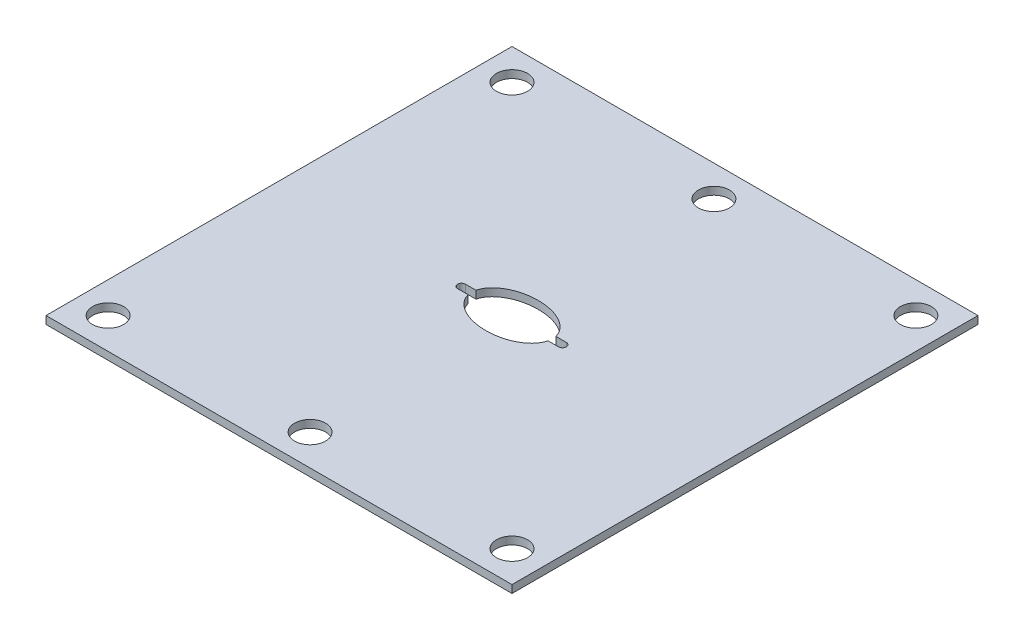
ISO-10303-21;
HEADER;
FILE_DESCRIPTION(('STEP AP214'),'2;1');
FILE_NAME('part.step','',(''),(''),'','','');
FILE_SCHEMA(('AUTOMOTIVE_DESIGN { 1 0 10303 214 1 1 1 1 }'));
ENDSEC;
DATA;
#1=APPLICATION_CONTEXT('core data for automotive mechanical design processes');
#2=APPLICATION_PROTOCOL_DEFINITION('international standard','automotive_design',2000,#1);
#3=PRODUCT_CONTEXT('',#1,'mechanical');
#4=PRODUCT('Part','Part','',(#3));
#5=PRODUCT_RELATED_PRODUCT_CATEGORY('part','',(#4));
#6=PRODUCT_DEFINITION_FORMATION('','',#4);
#7=PRODUCT_DEFINITION_CONTEXT('part definition',#1,'design');
#8=PRODUCT_DEFINITION('design','',#6,#7);
#9=PRODUCT_DEFINITION_SHAPE('','',#8);
#10=(LENGTH_UNIT() NAMED_UNIT(*) SI_UNIT(.MILLI.,.METRE.));
#11=(NAMED_UNIT(*) PLANE_ANGLE_UNIT() SI_UNIT($,.RADIAN.));
#12=(NAMED_UNIT(*) SI_UNIT($,.STERADIAN.) SOLID_ANGLE_UNIT());
#13=UNCERTAINTY_MEASURE_WITH_UNIT(LENGTH_MEASURE(1.E-05),#10,'distance_accuracy_value','');
#14=(GEOMETRIC_REPRESENTATION_CONTEXT(3) GLOBAL_UNCERTAINTY_ASSIGNED_CONTEXT((#13)) GLOBAL_UNIT_ASSIGNED_CONTEXT((#10,
#11,#12)) REPRESENTATION_CONTEXT('',''));
#15=CARTESIAN_POINT('',(0.,0.,0.));
#16=DIRECTION('',(0.,0.,1.));
#17=DIRECTION('',(1.,0.,0.));
#18=AXIS2_PLACEMENT_3D('',#15,#16,#17);
#19=CARTESIAN_POINT('',(6.5,-4.,0.499999999999996));
#20=DIRECTION('',(0.,0.,1.));
#21=DIRECTION('',(1.,0.,0.));
#22=AXIS2_PLACEMENT_3D('',#19,#20,#21);
#23=PLANE('',#22);
#24=DIRECTION('',(1.,0.,0.));
#25=VECTOR('',#24,1.);
#26=CARTESIAN_POINT('',(0.,0.,0.499999999999996));
#27=LINE('',#26,#25);
#28=CARTESIAN_POINT('',(5.13604626023031,0.,0.499999999999996));
#29=VERTEX_POINT('',#28);
#30=CARTESIAN_POINT('',(6.5,0.,0.499999999999996));
#31=VERTEX_POINT('',#30);
#32=EDGE_CURVE('E155',#29,#31,#27,.T.);
#33=ORIENTED_EDGE('',*,*,#32,.F.);
#34=DIRECTION('',(0.,1.,0.));
#35=VECTOR('',#34,1.);
#36=CARTESIAN_POINT('',(5.13604626023031,-4.,0.499999999999996));
#37=LINE('',#36,#35);
#38=CARTESIAN_POINT('',(5.13604626023031,1.,0.499999999999996));
#39=VERTEX_POINT('',#38);
#40=EDGE_CURVE('E148',#29,#39,#37,.T.);
#41=ORIENTED_EDGE('',*,*,#40,.T.);
#42=DIRECTION('',(1.,0.,0.));
#43=VECTOR('',#42,1.);
#44=CARTESIAN_POINT('',(6.5,1.,0.499999999999996));
#45=LINE('',#44,#43);
#46=CARTESIAN_POINT('',(6.5,1.,0.499999999999996));
#47=VERTEX_POINT('',#46);
#48=EDGE_CURVE('E138',#39,#47,#45,.T.);
#49=ORIENTED_EDGE('',*,*,#48,.T.);
#50=DIRECTION('',(0.,1.,0.));
#51=VECTOR('',#50,1.);
#52=CARTESIAN_POINT('',(6.5,-4.,0.499999999999996));
#53=LINE('',#52,#51);
#54=EDGE_CURVE('E152',#31,#47,#53,.T.);
#55=ORIENTED_EDGE('',*,*,#54,.F.);
#56=EDGE_LOOP('',(#33,#41,#49,#55));
#57=FACE_BOUND('',#56,.T.);
#58=ADVANCED_FACE('F34',(#57),#23,.F.);
#59=CARTESIAN_POINT('',(6.5,-4.,-0.499999999999996));
#60=DIRECTION('',(0.,0.,-1.));
#61=DIRECTION('',(-1.,0.,0.));
#62=AXIS2_PLACEMENT_3D('',#59,#60,#61);
#63=PLANE('',#62);
#64=DIRECTION('',(-1.,0.,0.));
#65=VECTOR('',#64,1.);
#66=CARTESIAN_POINT('',(0.,0.,-0.499999999999996));
#67=LINE('',#66,#65);
#68=CARTESIAN_POINT('',(-5.13604626023031,0.,-0.499999999999996));
#69=VERTEX_POINT('',#68);
#70=CARTESIAN_POINT('',(-6.5,0.,-0.499999999999996));
#71=VERTEX_POINT('',#70);
#72=EDGE_CURVE('E160',#69,#71,#67,.T.);
#73=ORIENTED_EDGE('',*,*,#72,.F.);
#74=DIRECTION('',(0.,1.,0.));
#75=VECTOR('',#74,1.);
#76=CARTESIAN_POINT('',(-5.13604626023031,-4.,-0.499999999999996));
#77=LINE('',#76,#75);
#78=CARTESIAN_POINT('',(-5.13604626023031,1.,-0.499999999999996));
#79=VERTEX_POINT('',#78);
#80=EDGE_CURVE('E11',#69,#79,#77,.T.);
#81=ORIENTED_EDGE('',*,*,#80,.T.);
#82=DIRECTION('',(-1.,0.,0.));
#83=VECTOR('',#82,1.);
#84=CARTESIAN_POINT('',(6.5,1.,-0.499999999999996));
#85=LINE('',#84,#83);
#86=CARTESIAN_POINT('',(-6.5,1.,-0.499999999999996));
#87=VERTEX_POINT('',#86);
#88=EDGE_CURVE('E144',#79,#87,#85,.T.);
#89=ORIENTED_EDGE('',*,*,#88,.T.);
#90=DIRECTION('',(0.,1.,0.));
#91=VECTOR('',#90,1.);
#92=CARTESIAN_POINT('',(-6.5,-4.,-0.499999999999996));
#93=LINE('',#92,#91);
#94=EDGE_CURVE('E242',#87,#71,#93,.F.);
#95=ORIENTED_EDGE('',*,*,#94,.T.);
#96=EDGE_LOOP('',(#73,#81,#89,#95));
#97=FACE_BOUND('',#96,.T.);
#98=ADVANCED_FACE('F264',(#97),#63,.F.);
#99=CARTESIAN_POINT('',(-6.5,-4.,0.));
#100=DIRECTION('',(0.,1.,0.));
#101=DIRECTION('',(0.,0.,1.));
#102=AXIS2_PLACEMENT_3D('',#99,#100,#101);
#103=CYLINDRICAL_SURFACE('',#102,0.5);
#104=ORIENTED_EDGE('',*,*,#94,.F.);
#105=CARTESIAN_POINT('',(-6.5,1.,0.));
#106=DIRECTION('',(0.,1.,0.));
#107=DIRECTION('',(0.,0.,1.));
#108=AXIS2_PLACEMENT_3D('',#105,#106,#107);
#109=CIRCLE('',#108,0.5);
#110=CARTESIAN_POINT('',(-6.5,1.,0.499999999999996));
#111=VERTEX_POINT('',#110);
#112=EDGE_CURVE('E164',#87,#111,#109,.T.);
#113=ORIENTED_EDGE('',*,*,#112,.T.);
#114=DIRECTION('',(0.,1.,0.));
#115=VECTOR('',#114,1.);
#116=CARTESIAN_POINT('',(-6.5,-4.,0.5));
#117=LINE('',#116,#115);
#118=CARTESIAN_POINT('',(-6.5,0.,0.500000000000003));
#119=VERTEX_POINT('',#118);
#120=EDGE_CURVE('E143',#111,#119,#117,.F.);
#121=ORIENTED_EDGE('',*,*,#120,.T.);
#122=CARTESIAN_POINT('',(-6.5,0.,0.));
#123=DIRECTION('',(0.,1.,0.));
#124=DIRECTION('',(0.,0.,1.));
#125=AXIS2_PLACEMENT_3D('',#122,#123,#124);
#126=CIRCLE('',#125,0.5);
#127=EDGE_CURVE('E166',#71,#119,#126,.T.);
#128=ORIENTED_EDGE('',*,*,#127,.F.);
#129=EDGE_LOOP('',(#104,#113,#121,#128));
#130=FACE_BOUND('',#129,.T.);
#131=ADVANCED_FACE('F269',(#130),#103,.F.);
#132=CARTESIAN_POINT('',(-30.,1.,30.));
#133=DIRECTION('',(1.,0.,0.));
#134=DIRECTION('',(0.,0.,-1.));
#135=AXIS2_PLACEMENT_3D('',#132,#133,#134);
#136=PLANE('',#135);
#137=DIRECTION('',(0.,0.,1.));
#138=VECTOR('',#137,1.);
#139=CARTESIAN_POINT('',(-30.,0.,30.));
#140=LINE('',#139,#138);
#141=CARTESIAN_POINT('',(-30.,0.,-30.));
#142=VERTEX_POINT('',#141);
#143=CARTESIAN_POINT('',(-30.,0.,30.));
#144=VERTEX_POINT('',#143);
#145=EDGE_CURVE('E207',#142,#144,#140,.T.);
#146=ORIENTED_EDGE('',*,*,#145,.T.);
#147=DIRECTION('',(0.,-1.,0.));
#148=VECTOR('',#147,1.);
#149=CARTESIAN_POINT('',(-30.,1.,30.));
#150=LINE('',#149,#148);
#151=CARTESIAN_POINT('',(-30.,1.,30.));
#152=VERTEX_POINT('',#151);
#153=EDGE_CURVE('E234',#152,#144,#150,.T.);
#154=ORIENTED_EDGE('',*,*,#153,.F.);
#155=DIRECTION('',(0.,0.,1.));
#156=VECTOR('',#155,1.);
#157=CARTESIAN_POINT('',(-30.,1.,30.));
#158=LINE('',#157,#156);
#159=CARTESIAN_POINT('',(-30.,1.,-30.));
#160=VERTEX_POINT('',#159);
#161=EDGE_CURVE('E208',#160,#152,#158,.T.);
#162=ORIENTED_EDGE('',*,*,#161,.F.);
#163=DIRECTION('',(0.,-1.,0.));
#164=VECTOR('',#163,1.);
#165=CARTESIAN_POINT('',(-30.,1.,-30.));
#166=LINE('',#165,#164);
#167=EDGE_CURVE('E218',#160,#142,#166,.T.);
#168=ORIENTED_EDGE('',*,*,#167,.T.);
#169=EDGE_LOOP('',(#146,#154,#162,#168));
#170=FACE_BOUND('',#169,.T.);
#171=ADVANCED_FACE('F36',(#170),#136,.F.);
#172=CARTESIAN_POINT('',(30.,1.,30.));
#173=DIRECTION('',(0.,0.,-1.));
#174=DIRECTION('',(-1.,0.,0.));
#175=AXIS2_PLACEMENT_3D('',#172,#173,#174);
#176=PLANE('',#175);
#177=DIRECTION('',(1.,0.,0.));
#178=VECTOR('',#177,1.);
#179=CARTESIAN_POINT('',(30.,0.,30.));
#180=LINE('',#179,#178);
#181=CARTESIAN_POINT('',(30.,0.,30.));
#182=VERTEX_POINT('',#181);
#183=EDGE_CURVE('E221',#144,#182,#180,.T.);
#184=ORIENTED_EDGE('',*,*,#183,.T.);
#185=DIRECTION('',(0.,-1.,0.));
#186=VECTOR('',#185,1.);
#187=CARTESIAN_POINT('',(30.,1.,30.));
#188=LINE('',#187,#186);
#189=CARTESIAN_POINT('',(30.,1.,30.));
#190=VERTEX_POINT('',#189);
#191=EDGE_CURVE('E231',#190,#182,#188,.T.);
#192=ORIENTED_EDGE('',*,*,#191,.F.);
#193=DIRECTION('',(1.,0.,0.));
#194=VECTOR('',#193,1.);
#195=CARTESIAN_POINT('',(30.,1.,30.));
#196=LINE('',#195,#194);
#197=EDGE_CURVE('E211',#152,#190,#196,.T.);
#198=ORIENTED_EDGE('',*,*,#197,.F.);
#199=ORIENTED_EDGE('',*,*,#153,.T.);
#200=EDGE_LOOP('',(#184,#192,#198,#199));
#201=FACE_BOUND('',#200,.T.);
#202=ADVANCED_FACE('F317',(#201),#176,.F.);
#203=CARTESIAN_POINT('',(30.,1.,30.));
#204=DIRECTION('',(-1.,0.,0.));
#205=DIRECTION('',(0.,0.,1.));
#206=AXIS2_PLACEMENT_3D('',#203,#204,#205);
#207=PLANE('',#206);
#208=DIRECTION('',(0.,0.,-1.));
#209=VECTOR('',#208,1.);
#210=CARTESIAN_POINT('',(30.,0.,30.));
#211=LINE('',#210,#209);
#212=CARTESIAN_POINT('',(30.,0.,-30.));
#213=VERTEX_POINT('',#212);
#214=EDGE_CURVE('E223',#182,#213,#211,.T.);
#215=ORIENTED_EDGE('',*,*,#214,.T.);
#216=DIRECTION('',(0.,-1.,0.));
#217=VECTOR('',#216,1.);
#218=CARTESIAN_POINT('',(30.,1.,-30.));
#219=LINE('',#218,#217);
#220=CARTESIAN_POINT('',(30.,1.,-30.));
#221=VERTEX_POINT('',#220);
#222=EDGE_CURVE('E228',#221,#213,#219,.T.);
#223=ORIENTED_EDGE('',*,*,#222,.F.);
#224=DIRECTION('',(0.,0.,-1.));
#225=VECTOR('',#224,1.);
#226=CARTESIAN_POINT('',(30.,1.,30.));
#227=LINE('',#226,#225);
#228=EDGE_CURVE('E214',#190,#221,#227,.T.);
#229=ORIENTED_EDGE('',*,*,#228,.F.);
#230=ORIENTED_EDGE('',*,*,#191,.T.);
#231=EDGE_LOOP('',(#215,#223,#229,#230));
#232=FACE_BOUND('',#231,.T.);
#233=ADVANCED_FACE('F314',(#232),#207,.F.);
#234=CARTESIAN_POINT('',(30.,1.,-30.));
#235=DIRECTION('',(0.,0.,1.));
#236=DIRECTION('',(1.,0.,0.));
#237=AXIS2_PLACEMENT_3D('',#234,#235,#236);
#238=PLANE('',#237);
#239=DIRECTION('',(-1.,0.,0.));
#240=VECTOR('',#239,1.);
#241=CARTESIAN_POINT('',(30.,0.,-30.));
#242=LINE('',#241,#240);
#243=EDGE_CURVE('E212',#213,#142,#242,.T.);
#244=ORIENTED_EDGE('',*,*,#243,.T.);
#245=ORIENTED_EDGE('',*,*,#167,.F.);
#246=DIRECTION('',(-1.,0.,0.));
#247=VECTOR('',#246,1.);
#248=CARTESIAN_POINT('',(30.,1.,-30.));
#249=LINE('',#248,#247);
#250=EDGE_CURVE('E216',#221,#160,#249,.T.);
#251=ORIENTED_EDGE('',*,*,#250,.F.);
#252=ORIENTED_EDGE('',*,*,#222,.T.);
#253=EDGE_LOOP('',(#244,#245,#251,#252));
#254=FACE_BOUND('',#253,.T.);
#255=ADVANCED_FACE('F309',(#254),#238,.F.);
#256=CARTESIAN_POINT('',(0.,1.,0.));
#257=DIRECTION('',(0.,1.,0.));
#258=DIRECTION('',(0.,0.,1.));
#259=AXIS2_PLACEMENT_3D('',#256,#257,#258);
#260=PLANE('',#259);
#261=CARTESIAN_POINT('',(0.,1.,0.));
#262=DIRECTION('',(0.,1.,0.));
#263=DIRECTION('',(-1.,0.,0.));
#264=AXIS2_PLACEMENT_3D('',#261,#262,#263);
#265=ELLIPSE('',#264,5.19355355723705,3.3692356937772);
#266=CARTESIAN_POINT('',(-5.13604626023031,1.,0.499999999999996));
#267=VERTEX_POINT('',#266);
#268=EDGE_CURVE('E123',#267,#39,#265,.T.);
#269=ORIENTED_EDGE('',*,*,#268,.F.);
#270=EDGE_CURVE('E135',#111,#267,#45,.T.);
#271=ORIENTED_EDGE('',*,*,#270,.F.);
#272=ORIENTED_EDGE('',*,*,#112,.F.);
#273=ORIENTED_EDGE('',*,*,#88,.F.);
#274=CARTESIAN_POINT('',(5.13604626023031,1.,-0.499999999999996));
#275=VERTEX_POINT('',#274);
#276=EDGE_CURVE('E139',#275,#79,#265,.T.);
#277=ORIENTED_EDGE('',*,*,#276,.F.);
#278=CARTESIAN_POINT('',(6.5,1.,-0.499999999999996));
#279=VERTEX_POINT('',#278);
#280=EDGE_CURVE('E146',#279,#275,#85,.T.);
#281=ORIENTED_EDGE('',*,*,#280,.F.);
#282=CARTESIAN_POINT('',(6.5,1.,0.));
#283=DIRECTION('',(0.,1.,0.));
#284=DIRECTION('',(0.,0.,1.));
#285=AXIS2_PLACEMENT_3D('',#282,#283,#284);
#286=CIRCLE('',#285,0.500000000000001);
#287=EDGE_CURVE('E167',#47,#279,#286,.T.);
#288=ORIENTED_EDGE('',*,*,#287,.F.);
#289=ORIENTED_EDGE('',*,*,#48,.F.);
#290=EDGE_LOOP('',(#269,#271,#272,#273,#277,#281,#288,#289));
#291=FACE_BOUND('',#290,.T.);
#292=CARTESIAN_POINT('',(26.,1.,-26.));
#293=DIRECTION('',(0.,1.,0.));
#294=DIRECTION('',(0.,0.,1.));
#295=AXIS2_PLACEMENT_3D('',#292,#293,#294);
#296=CIRCLE('',#295,2.);
#297=CARTESIAN_POINT('',(26.,1.,-24.));
#298=VERTEX_POINT('',#297);
#299=EDGE_CURVE('E171',#298,#298,#296,.T.);
#300=ORIENTED_EDGE('',*,*,#299,.F.);
#301=EDGE_LOOP('',(#300));
#302=FACE_BOUND('',#301,.T.);
#303=CARTESIAN_POINT('',(0.,1.,-26.));
#304=DIRECTION('',(0.,1.,0.));
#305=DIRECTION('',(0.,0.,1.));
#306=AXIS2_PLACEMENT_3D('',#303,#304,#305);
#307=CIRCLE('',#306,2.);
#308=CARTESIAN_POINT('',(0.,1.,-24.));
#309=VERTEX_POINT('',#308);
#310=EDGE_CURVE('E177',#309,#309,#307,.T.);
#311=ORIENTED_EDGE('',*,*,#310,.F.);
#312=EDGE_LOOP('',(#311));
#313=FACE_BOUND('',#312,.T.);
#314=CARTESIAN_POINT('',(-26.,1.,-26.));
#315=DIRECTION('',(0.,1.,0.));
#316=DIRECTION('',(0.,0.,1.));
#317=AXIS2_PLACEMENT_3D('',#314,#315,#316);
#318=CIRCLE('',#317,2.);
#319=CARTESIAN_POINT('',(-26.,1.,-24.));
#320=VERTEX_POINT('',#319);
#321=EDGE_CURVE('E183',#320,#320,#318,.T.);
#322=ORIENTED_EDGE('',*,*,#321,.F.);
#323=EDGE_LOOP('',(#322));
#324=FACE_BOUND('',#323,.T.);
#325=CARTESIAN_POINT('',(0.,1.,26.));
#326=DIRECTION('',(0.,1.,0.));
#327=DIRECTION('',(0.,0.,1.));
#328=AXIS2_PLACEMENT_3D('',#325,#326,#327);
#329=CIRCLE('',#328,2.);
#330=CARTESIAN_POINT('',(0.,1.,28.));
#331=VERTEX_POINT('',#330);
#332=EDGE_CURVE('E189',#331,#331,#329,.T.);
#333=ORIENTED_EDGE('',*,*,#332,.F.);
#334=EDGE_LOOP('',(#333));
#335=FACE_BOUND('',#334,.T.);
#336=CARTESIAN_POINT('',(26.,1.,26.));
#337=DIRECTION('',(0.,1.,0.));
#338=DIRECTION('',(0.,0.,1.));
#339=AXIS2_PLACEMENT_3D('',#336,#337,#338);
#340=CIRCLE('',#339,2.);
#341=CARTESIAN_POINT('',(26.,1.,28.));
#342=VERTEX_POINT('',#341);
#343=EDGE_CURVE('E195',#342,#342,#340,.T.);
#344=ORIENTED_EDGE('',*,*,#343,.F.);
#345=EDGE_LOOP('',(#344));
#346=FACE_BOUND('',#345,.T.);
#347=CARTESIAN_POINT('',(-26.,1.,26.));
#348=DIRECTION('',(0.,1.,0.));
#349=DIRECTION('',(0.,0.,1.));
#350=AXIS2_PLACEMENT_3D('',#347,#348,#349);
#351=CIRCLE('',#350,2.);
#352=CARTESIAN_POINT('',(-26.,1.,28.));
#353=VERTEX_POINT('',#352);
#354=EDGE_CURVE('E201',#353,#353,#351,.T.);
#355=ORIENTED_EDGE('',*,*,#354,.F.);
#356=EDGE_LOOP('',(#355));
#357=FACE_BOUND('',#356,.T.);
#358=ORIENTED_EDGE('',*,*,#161,.T.);
#359=ORIENTED_EDGE('',*,*,#197,.T.);
#360=ORIENTED_EDGE('',*,*,#228,.T.);
#361=ORIENTED_EDGE('',*,*,#250,.T.);
#362=EDGE_LOOP('',(#358,#359,#360,#361));
#363=FACE_BOUND('',#362,.T.);
#364=ADVANCED_FACE('F132',(#291,#302,#313,#324,#335,#346,#357,#363),#260,.T.);
#365=CARTESIAN_POINT('',(0.,0.,0.));
#366=DIRECTION('',(0.,1.,0.));
#367=DIRECTION('',(0.,0.,1.));
#368=AXIS2_PLACEMENT_3D('',#365,#366,#367);
#369=PLANE('',#368);
#370=CARTESIAN_POINT('',(-5.13604626023031,0.,0.499999999999996));
#371=VERTEX_POINT('',#370);
#372=EDGE_CURVE('E158',#119,#371,#27,.T.);
#373=ORIENTED_EDGE('',*,*,#372,.T.);
#374=CARTESIAN_POINT('',(0.,0.,0.));
#375=DIRECTION('',(0.,1.,0.));
#376=DIRECTION('',(-1.,0.,0.));
#377=AXIS2_PLACEMENT_3D('',#374,#375,#376);
#378=ELLIPSE('',#377,5.19355355723705,3.3692356937772);
#379=EDGE_CURVE('E49',#371,#29,#378,.T.);
#380=ORIENTED_EDGE('',*,*,#379,.T.);
#381=ORIENTED_EDGE('',*,*,#32,.T.);
#382=CARTESIAN_POINT('',(6.5,0.,0.));
#383=DIRECTION('',(0.,1.,0.));
#384=DIRECTION('',(0.,0.,1.));
#385=AXIS2_PLACEMENT_3D('',#382,#383,#384);
#386=CIRCLE('',#385,0.500000000000001);
#387=CARTESIAN_POINT('',(6.5,0.,-0.499999999999996));
#388=VERTEX_POINT('',#387);
#389=EDGE_CURVE('E170',#31,#388,#386,.T.);
#390=ORIENTED_EDGE('',*,*,#389,.T.);
#391=CARTESIAN_POINT('',(5.13604626023031,0.,-0.499999999999996));
#392=VERTEX_POINT('',#391);
#393=EDGE_CURVE('E161',#388,#392,#67,.T.);
#394=ORIENTED_EDGE('',*,*,#393,.T.);
#395=EDGE_CURVE('E57',#392,#69,#378,.T.);
#396=ORIENTED_EDGE('',*,*,#395,.T.);
#397=ORIENTED_EDGE('',*,*,#72,.T.);
#398=ORIENTED_EDGE('',*,*,#127,.T.);
#399=EDGE_LOOP('',(#373,#380,#381,#390,#394,#396,#397,#398));
#400=FACE_BOUND('',#399,.T.);
#401=CARTESIAN_POINT('',(26.,0.,-26.));
#402=DIRECTION('',(0.,1.,0.));
#403=DIRECTION('',(0.,0.,1.));
#404=AXIS2_PLACEMENT_3D('',#401,#402,#403);
#405=CIRCLE('',#404,2.);
#406=CARTESIAN_POINT('',(26.,0.,-24.));
#407=VERTEX_POINT('',#406);
#408=EDGE_CURVE('E174',#407,#407,#405,.T.);
#409=ORIENTED_EDGE('',*,*,#408,.T.);
#410=EDGE_LOOP('',(#409));
#411=FACE_BOUND('',#410,.T.);
#412=CARTESIAN_POINT('',(0.,0.,-26.));
#413=DIRECTION('',(0.,1.,0.));
#414=DIRECTION('',(0.,0.,1.));
#415=AXIS2_PLACEMENT_3D('',#412,#413,#414);
#416=CIRCLE('',#415,2.);
#417=CARTESIAN_POINT('',(0.,0.,-24.));
#418=VERTEX_POINT('',#417);
#419=EDGE_CURVE('E180',#418,#418,#416,.T.);
#420=ORIENTED_EDGE('',*,*,#419,.T.);
#421=EDGE_LOOP('',(#420));
#422=FACE_BOUND('',#421,.T.);
#423=CARTESIAN_POINT('',(-26.,0.,-26.));
#424=DIRECTION('',(0.,1.,0.));
#425=DIRECTION('',(0.,0.,1.));
#426=AXIS2_PLACEMENT_3D('',#423,#424,#425);
#427=CIRCLE('',#426,2.);
#428=CARTESIAN_POINT('',(-26.,0.,-24.));
#429=VERTEX_POINT('',#428);
#430=EDGE_CURVE('E186',#429,#429,#427,.T.);
#431=ORIENTED_EDGE('',*,*,#430,.T.);
#432=EDGE_LOOP('',(#431));
#433=FACE_BOUND('',#432,.T.);
#434=CARTESIAN_POINT('',(0.,0.,26.));
#435=DIRECTION('',(0.,1.,0.));
#436=DIRECTION('',(0.,0.,1.));
#437=AXIS2_PLACEMENT_3D('',#434,#435,#436);
#438=CIRCLE('',#437,2.);
#439=CARTESIAN_POINT('',(0.,0.,28.));
#440=VERTEX_POINT('',#439);
#441=EDGE_CURVE('E192',#440,#440,#438,.T.);
#442=ORIENTED_EDGE('',*,*,#441,.T.);
#443=EDGE_LOOP('',(#442));
#444=FACE_BOUND('',#443,.T.);
#445=CARTESIAN_POINT('',(26.,0.,26.));
#446=DIRECTION('',(0.,1.,0.));
#447=DIRECTION('',(0.,0.,1.));
#448=AXIS2_PLACEMENT_3D('',#445,#446,#447);
#449=CIRCLE('',#448,2.);
#450=CARTESIAN_POINT('',(26.,0.,28.));
#451=VERTEX_POINT('',#450);
#452=EDGE_CURVE('E198',#451,#451,#449,.T.);
#453=ORIENTED_EDGE('',*,*,#452,.T.);
#454=EDGE_LOOP('',(#453));
#455=FACE_BOUND('',#454,.T.);
#456=CARTESIAN_POINT('',(-26.,0.,26.));
#457=DIRECTION('',(0.,1.,0.));
#458=DIRECTION('',(0.,0.,1.));
#459=AXIS2_PLACEMENT_3D('',#456,#457,#458);
#460=CIRCLE('',#459,2.);
#461=CARTESIAN_POINT('',(-26.,0.,28.));
#462=VERTEX_POINT('',#461);
#463=EDGE_CURVE('E204',#462,#462,#460,.T.);
#464=ORIENTED_EDGE('',*,*,#463,.T.);
#465=EDGE_LOOP('',(#464));
#466=FACE_BOUND('',#465,.T.);
#467=ORIENTED_EDGE('',*,*,#145,.F.);
#468=ORIENTED_EDGE('',*,*,#243,.F.);
#469=ORIENTED_EDGE('',*,*,#214,.F.);
#470=ORIENTED_EDGE('',*,*,#183,.F.);
#471=EDGE_LOOP('',(#467,#468,#469,#470));
#472=FACE_BOUND('',#471,.T.);
#473=ADVANCED_FACE('F250',(#400,#411,#422,#433,#444,#455,#466,#472),#369,.F.);
#474=CARTESIAN_POINT('',(-26.,1.,26.));
#475=DIRECTION('',(0.,1.,0.));
#476=DIRECTION('',(0.,0.,1.));
#477=AXIS2_PLACEMENT_3D('',#474,#475,#476);
#478=CYLINDRICAL_SURFACE('',#477,2.);
#479=ORIENTED_EDGE('',*,*,#463,.F.);
#480=EDGE_LOOP('',(#479));
#481=FACE_BOUND('',#480,.T.);
#482=ORIENTED_EDGE('',*,*,#354,.T.);
#483=EDGE_LOOP('',(#482));
#484=FACE_BOUND('',#483,.T.);
#485=ADVANCED_FACE('F302',(#481,#484),#478,.F.);
#486=CARTESIAN_POINT('',(26.,1.,26.));
#487=DIRECTION('',(0.,1.,0.));
#488=DIRECTION('',(0.,0.,1.));
#489=AXIS2_PLACEMENT_3D('',#486,#487,#488);
#490=CYLINDRICAL_SURFACE('',#489,2.);
#491=ORIENTED_EDGE('',*,*,#452,.F.);
#492=EDGE_LOOP('',(#491));
#493=FACE_BOUND('',#492,.T.);
#494=ORIENTED_EDGE('',*,*,#343,.T.);
#495=EDGE_LOOP('',(#494));
#496=FACE_BOUND('',#495,.T.);
#497=ADVANCED_FACE('F298',(#493,#496),#490,.F.);
#498=CARTESIAN_POINT('',(0.,1.,26.));
#499=DIRECTION('',(0.,1.,0.));
#500=DIRECTION('',(0.,0.,1.));
#501=AXIS2_PLACEMENT_3D('',#498,#499,#500);
#502=CYLINDRICAL_SURFACE('',#501,2.);
#503=ORIENTED_EDGE('',*,*,#441,.F.);
#504=EDGE_LOOP('',(#503));
#505=FACE_BOUND('',#504,.T.);
#506=ORIENTED_EDGE('',*,*,#332,.T.);
#507=EDGE_LOOP('',(#506));
#508=FACE_BOUND('',#507,.T.);
#509=ADVANCED_FACE('F294',(#505,#508),#502,.F.);
#510=CARTESIAN_POINT('',(-26.,1.,-26.));
#511=DIRECTION('',(0.,1.,0.));
#512=DIRECTION('',(0.,0.,1.));
#513=AXIS2_PLACEMENT_3D('',#510,#511,#512);
#514=CYLINDRICAL_SURFACE('',#513,2.);
#515=ORIENTED_EDGE('',*,*,#430,.F.);
#516=EDGE_LOOP('',(#515));
#517=FACE_BOUND('',#516,.T.);
#518=ORIENTED_EDGE('',*,*,#321,.T.);
#519=EDGE_LOOP('',(#518));
#520=FACE_BOUND('',#519,.T.);
#521=ADVANCED_FACE('F290',(#517,#520),#514,.F.);
#522=CARTESIAN_POINT('',(0.,1.,-26.));
#523=DIRECTION('',(0.,1.,0.));
#524=DIRECTION('',(0.,0.,1.));
#525=AXIS2_PLACEMENT_3D('',#522,#523,#524);
#526=CYLINDRICAL_SURFACE('',#525,2.);
#527=ORIENTED_EDGE('',*,*,#419,.F.);
#528=EDGE_LOOP('',(#527));
#529=FACE_BOUND('',#528,.T.);
#530=ORIENTED_EDGE('',*,*,#310,.T.);
#531=EDGE_LOOP('',(#530));
#532=FACE_BOUND('',#531,.T.);
#533=ADVANCED_FACE('F284',(#529,#532),#526,.F.);
#534=CARTESIAN_POINT('',(26.,1.,-26.));
#535=DIRECTION('',(0.,1.,0.));
#536=DIRECTION('',(0.,0.,1.));
#537=AXIS2_PLACEMENT_3D('',#534,#535,#536);
#538=CYLINDRICAL_SURFACE('',#537,2.);
#539=ORIENTED_EDGE('',*,*,#408,.F.);
#540=EDGE_LOOP('',(#539));
#541=FACE_BOUND('',#540,.T.);
#542=ORIENTED_EDGE('',*,*,#299,.T.);
#543=EDGE_LOOP('',(#542));
#544=FACE_BOUND('',#543,.T.);
#545=ADVANCED_FACE('F279',(#541,#544),#538,.F.);
#546=CARTESIAN_POINT('',(6.5,-4.,0.));
#547=DIRECTION('',(0.,1.,0.));
#548=DIRECTION('',(0.,0.,1.));
#549=AXIS2_PLACEMENT_3D('',#546,#547,#548);
#550=CYLINDRICAL_SURFACE('',#549,0.500000000000001);
#551=ORIENTED_EDGE('',*,*,#287,.T.);
#552=DIRECTION('',(0.,1.,0.));
#553=VECTOR('',#552,1.);
#554=CARTESIAN_POINT('',(6.5,-4.,-0.499999999999996));
#555=LINE('',#554,#553);
#556=EDGE_CURVE('E153',#388,#279,#555,.T.);
#557=ORIENTED_EDGE('',*,*,#556,.F.);
#558=ORIENTED_EDGE('',*,*,#389,.F.);
#559=ORIENTED_EDGE('',*,*,#54,.T.);
#560=EDGE_LOOP('',(#551,#557,#558,#559));
#561=FACE_BOUND('',#560,.T.);
#562=ADVANCED_FACE('F257',(#561),#550,.F.);
#563=ORIENTED_EDGE('',*,*,#270,.T.);
#564=DIRECTION('',(0.,1.,0.));
#565=VECTOR('',#564,1.);
#566=CARTESIAN_POINT('',(-5.13604626023031,-4.,0.499999999999996));
#567=LINE('',#566,#565);
#568=EDGE_CURVE('E120',#267,#371,#567,.F.);
#569=ORIENTED_EDGE('',*,*,#568,.T.);
#570=ORIENTED_EDGE('',*,*,#372,.F.);
#571=ORIENTED_EDGE('',*,*,#120,.F.);
#572=EDGE_LOOP('',(#563,#569,#570,#571));
#573=FACE_BOUND('',#572,.T.);
#574=ADVANCED_FACE('F141',(#573),#23,.F.);
#575=ORIENTED_EDGE('',*,*,#280,.T.);
#576=DIRECTION('',(0.,1.,0.));
#577=VECTOR('',#576,1.);
#578=CARTESIAN_POINT('',(5.13604626023031,-4.,-0.499999999999996));
#579=LINE('',#578,#577);
#580=EDGE_CURVE('E42',#275,#392,#579,.F.);
#581=ORIENTED_EDGE('',*,*,#580,.T.);
#582=ORIENTED_EDGE('',*,*,#393,.F.);
#583=ORIENTED_EDGE('',*,*,#556,.T.);
#584=EDGE_LOOP('',(#575,#581,#582,#583));
#585=FACE_BOUND('',#584,.T.);
#586=ADVANCED_FACE('F245',(#585),#63,.F.);
#587=CARTESIAN_POINT('',(0.,-4.,0.));
#588=DIRECTION('',(0.,1.,0.));
#589=DIRECTION('',(-1.,0.,0.));
#590=AXIS2_PLACEMENT_3D('',#587,#588,#589);
#591=ELLIPSE('',#590,5.19355355723705,3.3692356937772);
#592=DIRECTION('',(0.,1.,0.));
#593=VECTOR('',#592,1.);
#594=SURFACE_OF_LINEAR_EXTRUSION('',#591,#593);
#595=ORIENTED_EDGE('',*,*,#395,.F.);
#596=ORIENTED_EDGE('',*,*,#580,.F.);
#597=ORIENTED_EDGE('',*,*,#276,.T.);
#598=ORIENTED_EDGE('',*,*,#80,.F.);
#599=EDGE_LOOP('',(#595,#596,#597,#598));
#600=FACE_BOUND('',#599,.T.);
#601=ADVANCED_FACE('F278',(#600),#594,.F.);
#602=ORIENTED_EDGE('',*,*,#379,.F.);
#603=ORIENTED_EDGE('',*,*,#568,.F.);
#604=ORIENTED_EDGE('',*,*,#268,.T.);
#605=ORIENTED_EDGE('',*,*,#40,.F.);
#606=EDGE_LOOP('',(#602,#603,#604,#605));
#607=FACE_BOUND('',#606,.T.);
#608=ADVANCED_FACE('F122',(#607),#594,.F.);
#609=CLOSED_SHELL('',(#58,#98,#131,#171,#202,#233,#255,#364,#473,#485,#497,#509,#521,#533,#545,
#562,#574,#586,#601,#608));
#610=MANIFOLD_SOLID_BREP('B2',#609);
#611=ADVANCED_BREP_SHAPE_REPRESENTATION('',(#18,#610),#14);
#612=SHAPE_DEFINITION_REPRESENTATION(#9,#611);
ENDSEC;
END-ISO-10303-21;
